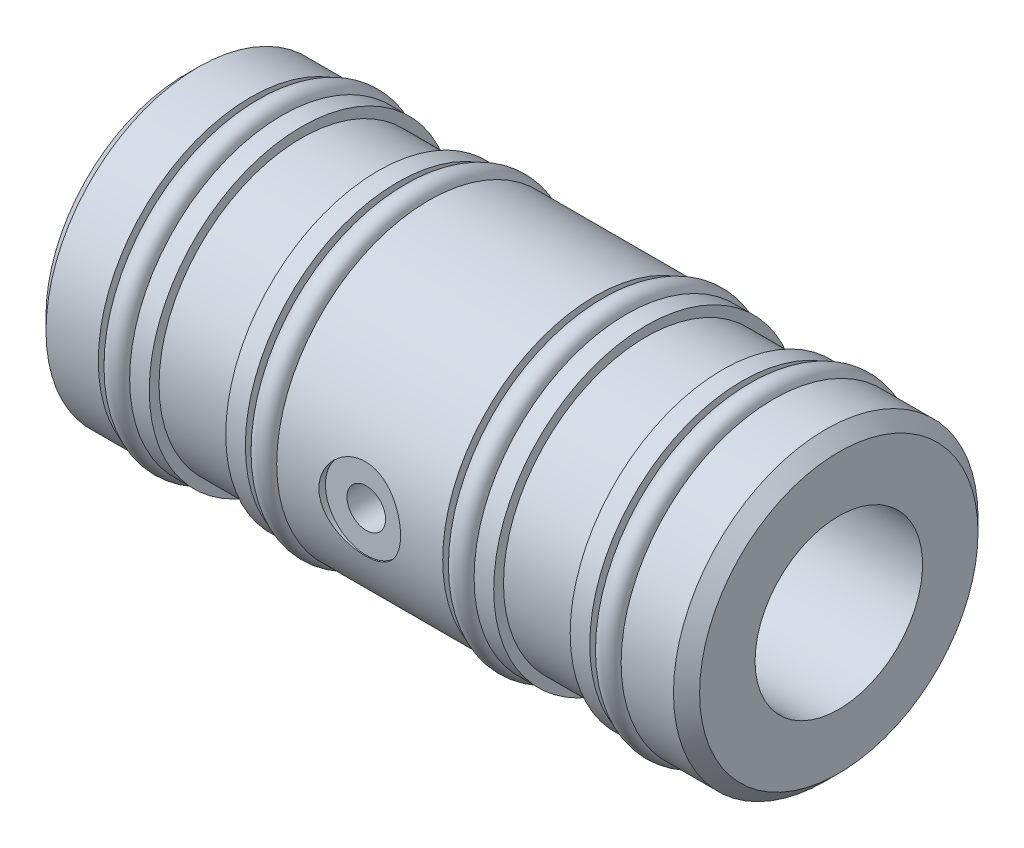
ISO-10303-21;
HEADER;
FILE_DESCRIPTION(('STEP AP214'),'2;1');
FILE_NAME('part.step','',(''),(''),'','','');
FILE_SCHEMA(('AUTOMOTIVE_DESIGN { 1 0 10303 214 1 1 1 1 }'));
ENDSEC;
DATA;
#1=APPLICATION_CONTEXT('core data for automotive mechanical design processes');
#2=APPLICATION_PROTOCOL_DEFINITION('international standard','automotive_design',2000,#1);
#3=PRODUCT_CONTEXT('',#1,'mechanical');
#4=PRODUCT('Part','Part','',(#3));
#5=PRODUCT_RELATED_PRODUCT_CATEGORY('part','',(#4));
#6=PRODUCT_DEFINITION_FORMATION('','',#4);
#7=PRODUCT_DEFINITION_CONTEXT('part definition',#1,'design');
#8=PRODUCT_DEFINITION('design','',#6,#7);
#9=PRODUCT_DEFINITION_SHAPE('','',#8);
#10=(LENGTH_UNIT() NAMED_UNIT(*) SI_UNIT(.MILLI.,.METRE.));
#11=(NAMED_UNIT(*) PLANE_ANGLE_UNIT() SI_UNIT($,.RADIAN.));
#12=(NAMED_UNIT(*) SI_UNIT($,.STERADIAN.) SOLID_ANGLE_UNIT());
#13=UNCERTAINTY_MEASURE_WITH_UNIT(LENGTH_MEASURE(1.E-05),#10,'distance_accuracy_value','');
#14=(GEOMETRIC_REPRESENTATION_CONTEXT(3) GLOBAL_UNCERTAINTY_ASSIGNED_CONTEXT((#13)) GLOBAL_UNIT_ASSIGNED_CONTEXT((#10,
#11,#12)) REPRESENTATION_CONTEXT('',''));
#15=CARTESIAN_POINT('',(0.,0.,0.));
#16=DIRECTION('',(0.,0.,1.));
#17=DIRECTION('',(1.,0.,0.));
#18=AXIS2_PLACEMENT_3D('',#15,#16,#17);
#19=CARTESIAN_POINT('',(0.,0.,0.));
#20=DIRECTION('',(-1.,0.,0.));
#21=DIRECTION('',(0.,0.,1.));
#22=AXIS2_PLACEMENT_3D('',#19,#20,#21);
#23=CYLINDRICAL_SURFACE('',#22,10.615);
#24=CARTESIAN_POINT('',(5.08,0.,0.));
#25=DIRECTION('',(-1.,0.,0.));
#26=DIRECTION('',(0.,0.,1.));
#27=AXIS2_PLACEMENT_3D('',#24,#25,#26);
#28=CIRCLE('',#27,10.615);
#29=CARTESIAN_POINT('',(5.08,0.,10.615));
#30=VERTEX_POINT('',#29);
#31=EDGE_CURVE('E200',#30,#30,#28,.T.);
#32=ORIENTED_EDGE('',*,*,#31,.F.);
#33=EDGE_LOOP('',(#32));
#34=FACE_BOUND('',#33,.T.);
#35=CARTESIAN_POINT('',(5.86030712662578,0.,0.));
#36=DIRECTION('',(1.,0.,0.));
#37=DIRECTION('',(0.,0.,-1.));
#38=AXIS2_PLACEMENT_3D('',#35,#36,#37);
#39=CIRCLE('',#38,10.615);
#40=CARTESIAN_POINT('',(5.86030712662578,0.,-10.615));
#41=VERTEX_POINT('',#40);
#42=EDGE_CURVE('E13',#41,#41,#39,.T.);
#43=ORIENTED_EDGE('',*,*,#42,.F.);
#44=EDGE_LOOP('',(#43));
#45=FACE_BOUND('',#44,.T.);
#46=ADVANCED_FACE('F44',(#34,#45),#23,.T.);
#47=CARTESIAN_POINT('',(7.51800000000001,0.,0.));
#48=DIRECTION('',(-1.,0.,0.));
#49=DIRECTION('',(0.,0.,1.));
#50=AXIS2_PLACEMENT_3D('',#47,#48,#49);
#51=CIRCLE('',#50,10.615);
#52=CARTESIAN_POINT('',(7.51800000000001,0.,10.615));
#53=VERTEX_POINT('',#52);
#54=EDGE_CURVE('E283',#53,#53,#51,.T.);
#55=ORIENTED_EDGE('',*,*,#54,.T.);
#56=EDGE_LOOP('',(#55));
#57=FACE_BOUND('',#56,.T.);
#58=CARTESIAN_POINT('',(6.73729287337424,0.,0.));
#59=DIRECTION('',(-1.,0.,0.));
#60=DIRECTION('',(0.,0.,1.));
#61=AXIS2_PLACEMENT_3D('',#58,#59,#60);
#62=CIRCLE('',#61,10.615);
#63=CARTESIAN_POINT('',(6.73729287337424,0.,10.615));
#64=VERTEX_POINT('',#63);
#65=EDGE_CURVE('E52',#64,#64,#62,.T.);
#66=ORIENTED_EDGE('',*,*,#65,.F.);
#67=EDGE_LOOP('',(#66));
#68=FACE_BOUND('',#67,.T.);
#69=ADVANCED_FACE('F157',(#57,#68),#23,.T.);
#70=CARTESIAN_POINT('',(0.,0.,0.));
#71=DIRECTION('',(-1.,0.,0.));
#72=DIRECTION('',(0.,0.,1.));
#73=AXIS2_PLACEMENT_3D('',#70,#71,#72);
#74=CYLINDRICAL_SURFACE('',#73,10.615);
#75=CARTESIAN_POINT('',(16.51,0.,0.));
#76=DIRECTION('',(-1.,0.,0.));
#77=DIRECTION('',(0.,0.,1.));
#78=AXIS2_PLACEMENT_3D('',#75,#76,#77);
#79=CIRCLE('',#78,10.615);
#80=CARTESIAN_POINT('',(16.51,0.,10.615));
#81=VERTEX_POINT('',#80);
#82=EDGE_CURVE('E262',#81,#81,#79,.T.);
#83=ORIENTED_EDGE('',*,*,#82,.F.);
#84=EDGE_LOOP('',(#83));
#85=FACE_BOUND('',#84,.T.);
#86=CARTESIAN_POINT('',(17.2895071266258,0.,0.));
#87=DIRECTION('',(1.,0.,0.));
#88=DIRECTION('',(0.,0.,-1.));
#89=AXIS2_PLACEMENT_3D('',#86,#87,#88);
#90=CIRCLE('',#89,10.615);
#91=CARTESIAN_POINT('',(17.2895071266258,0.,-10.615));
#92=VERTEX_POINT('',#91);
#93=EDGE_CURVE('E334',#92,#92,#90,.T.);
#94=ORIENTED_EDGE('',*,*,#93,.F.);
#95=EDGE_LOOP('',(#94));
#96=FACE_BOUND('',#95,.T.);
#97=ADVANCED_FACE('F163',(#85,#96),#74,.T.);
#98=CARTESIAN_POINT('',(18.948,0.,0.));
#99=DIRECTION('',(-1.,0.,0.));
#100=DIRECTION('',(0.,0.,1.));
#101=AXIS2_PLACEMENT_3D('',#98,#99,#100);
#102=CIRCLE('',#101,10.615);
#103=CARTESIAN_POINT('',(18.948,0.,10.615));
#104=VERTEX_POINT('',#103);
#105=EDGE_CURVE('E259',#104,#104,#102,.T.);
#106=ORIENTED_EDGE('',*,*,#105,.T.);
#107=EDGE_LOOP('',(#106));
#108=FACE_BOUND('',#107,.T.);
#109=CARTESIAN_POINT('',(18.1664928733742,0.,0.));
#110=DIRECTION('',(-1.,0.,0.));
#111=DIRECTION('',(0.,0.,1.));
#112=AXIS2_PLACEMENT_3D('',#109,#110,#111);
#113=CIRCLE('',#112,10.615);
#114=CARTESIAN_POINT('',(18.1664928733742,0.,10.615));
#115=VERTEX_POINT('',#114);
#116=EDGE_CURVE('E336',#115,#115,#113,.T.);
#117=ORIENTED_EDGE('',*,*,#116,.F.);
#118=EDGE_LOOP('',(#117));
#119=FACE_BOUND('',#118,.T.);
#120=ADVANCED_FACE('F146',(#108,#119),#74,.T.);
#121=CARTESIAN_POINT('',(0.,0.,0.));
#122=DIRECTION('',(-1.,0.,0.));
#123=DIRECTION('',(0.,0.,1.));
#124=AXIS2_PLACEMENT_3D('',#121,#122,#123);
#125=CYLINDRICAL_SURFACE('',#124,10.615);
#126=CARTESIAN_POINT('',(31.85,0.,0.));
#127=DIRECTION('',(-1.,0.,0.));
#128=DIRECTION('',(0.,0.,1.));
#129=AXIS2_PLACEMENT_3D('',#126,#127,#128);
#130=CIRCLE('',#129,10.615);
#131=CARTESIAN_POINT('',(31.85,0.,10.615));
#132=VERTEX_POINT('',#131);
#133=EDGE_CURVE('E250',#132,#132,#130,.T.);
#134=ORIENTED_EDGE('',*,*,#133,.F.);
#135=EDGE_LOOP('',(#134));
#136=FACE_BOUND('',#135,.T.);
#137=CARTESIAN_POINT('',(32.6315071266258,0.,0.));
#138=DIRECTION('',(1.,0.,0.));
#139=DIRECTION('',(0.,0.,-1.));
#140=AXIS2_PLACEMENT_3D('',#137,#138,#139);
#141=CIRCLE('',#140,10.615);
#142=CARTESIAN_POINT('',(32.6315071266258,0.,-10.615));
#143=VERTEX_POINT('',#142);
#144=EDGE_CURVE('E340',#143,#143,#141,.T.);
#145=ORIENTED_EDGE('',*,*,#144,.F.);
#146=EDGE_LOOP('',(#145));
#147=FACE_BOUND('',#146,.T.);
#148=ADVANCED_FACE('F144',(#136,#147),#125,.T.);
#149=CARTESIAN_POINT('',(34.288,0.,0.));
#150=DIRECTION('',(-1.,0.,0.));
#151=DIRECTION('',(0.,0.,1.));
#152=AXIS2_PLACEMENT_3D('',#149,#150,#151);
#153=CIRCLE('',#152,10.615);
#154=CARTESIAN_POINT('',(34.288,0.,10.615));
#155=VERTEX_POINT('',#154);
#156=EDGE_CURVE('E247',#155,#155,#153,.T.);
#157=ORIENTED_EDGE('',*,*,#156,.T.);
#158=EDGE_LOOP('',(#157));
#159=FACE_BOUND('',#158,.T.);
#160=CARTESIAN_POINT('',(33.5084928733742,0.,0.));
#161=DIRECTION('',(-1.,0.,0.));
#162=DIRECTION('',(0.,0.,1.));
#163=AXIS2_PLACEMENT_3D('',#160,#161,#162);
#164=CIRCLE('',#163,10.615);
#165=CARTESIAN_POINT('',(33.5084928733742,0.,10.615));
#166=VERTEX_POINT('',#165);
#167=EDGE_CURVE('E345',#166,#166,#164,.T.);
#168=ORIENTED_EDGE('',*,*,#167,.F.);
#169=EDGE_LOOP('',(#168));
#170=FACE_BOUND('',#169,.T.);
#171=ADVANCED_FACE('F114',(#159,#170),#125,.T.);
#172=CARTESIAN_POINT('',(0.,0.,0.));
#173=DIRECTION('',(-1.,0.,0.));
#174=DIRECTION('',(0.,0.,1.));
#175=AXIS2_PLACEMENT_3D('',#172,#173,#174);
#176=CYLINDRICAL_SURFACE('',#175,10.615);
#177=CARTESIAN_POINT('',(43.28,0.,0.));
#178=DIRECTION('',(-1.,0.,0.));
#179=DIRECTION('',(0.,0.,1.));
#180=AXIS2_PLACEMENT_3D('',#177,#178,#179);
#181=CIRCLE('',#180,10.615);
#182=CARTESIAN_POINT('',(43.28,0.,10.615));
#183=VERTEX_POINT('',#182);
#184=EDGE_CURVE('E226',#183,#183,#181,.T.);
#185=ORIENTED_EDGE('',*,*,#184,.F.);
#186=EDGE_LOOP('',(#185));
#187=FACE_BOUND('',#186,.T.);
#188=CARTESIAN_POINT('',(44.0615071266258,0.,0.));
#189=DIRECTION('',(1.,0.,0.));
#190=DIRECTION('',(0.,0.,-1.));
#191=AXIS2_PLACEMENT_3D('',#188,#189,#190);
#192=CIRCLE('',#191,10.615);
#193=CARTESIAN_POINT('',(44.0615071266258,0.,-10.615));
#194=VERTEX_POINT('',#193);
#195=EDGE_CURVE('E69',#194,#194,#192,.T.);
#196=ORIENTED_EDGE('',*,*,#195,.F.);
#197=EDGE_LOOP('',(#196));
#198=FACE_BOUND('',#197,.T.);
#199=ADVANCED_FACE('F110',(#187,#198),#176,.T.);
#200=CARTESIAN_POINT('',(45.718,0.,0.));
#201=DIRECTION('',(-1.,0.,0.));
#202=DIRECTION('',(0.,0.,1.));
#203=AXIS2_PLACEMENT_3D('',#200,#201,#202);
#204=CIRCLE('',#203,10.615);
#205=CARTESIAN_POINT('',(45.718,0.,10.615));
#206=VERTEX_POINT('',#205);
#207=EDGE_CURVE('E217',#206,#206,#204,.T.);
#208=ORIENTED_EDGE('',*,*,#207,.T.);
#209=EDGE_LOOP('',(#208));
#210=FACE_BOUND('',#209,.T.);
#211=CARTESIAN_POINT('',(44.9384928733742,0.,0.));
#212=DIRECTION('',(-1.,0.,0.));
#213=DIRECTION('',(0.,0.,1.));
#214=AXIS2_PLACEMENT_3D('',#211,#212,#213);
#215=CIRCLE('',#214,10.615);
#216=CARTESIAN_POINT('',(44.9384928733742,0.,10.615));
#217=VERTEX_POINT('',#216);
#218=EDGE_CURVE('E67',#217,#217,#215,.T.);
#219=ORIENTED_EDGE('',*,*,#218,.F.);
#220=EDGE_LOOP('',(#219));
#221=FACE_BOUND('',#220,.T.);
#222=ADVANCED_FACE('F113',(#210,#221),#176,.T.);
#223=CARTESIAN_POINT('',(0.,6.51,0.));
#224=DIRECTION('',(1.,0.,0.));
#225=DIRECTION('',(0.,0.,-1.));
#226=AXIS2_PLACEMENT_3D('',#223,#224,#225);
#227=PLANE('',#226);
#228=CARTESIAN_POINT('',(0.,0.,0.));
#229=DIRECTION('',(1.,0.,0.));
#230=DIRECTION('',(0.,0.,-1.));
#231=AXIS2_PLACEMENT_3D('',#228,#229,#230);
#232=CIRCLE('',#231,10.819);
#233=CARTESIAN_POINT('',(0.,0.,-10.819));
#234=VERTEX_POINT('',#233);
#235=EDGE_CURVE('E194',#234,#234,#232,.F.);
#236=ORIENTED_EDGE('',*,*,#235,.T.);
#237=EDGE_LOOP('',(#236));
#238=FACE_BOUND('',#237,.T.);
#239=CARTESIAN_POINT('',(0.,0.,0.));
#240=DIRECTION('',(-1.,0.,0.));
#241=DIRECTION('',(0.,0.,1.));
#242=AXIS2_PLACEMENT_3D('',#239,#240,#241);
#243=CIRCLE('',#242,6.51);
#244=CARTESIAN_POINT('',(0.,0.,6.51));
#245=VERTEX_POINT('',#244);
#246=EDGE_CURVE('E214',#245,#245,#243,.T.);
#247=ORIENTED_EDGE('',*,*,#246,.F.);
#248=EDGE_LOOP('',(#247));
#249=FACE_BOUND('',#248,.T.);
#250=ADVANCED_FACE('F178',(#238,#249),#227,.F.);
#251=CARTESIAN_POINT('',(0.,0.,0.));
#252=DIRECTION('',(-1.,0.,0.));
#253=DIRECTION('',(0.,0.,1.));
#254=AXIS2_PLACEMENT_3D('',#251,#252,#253);
#255=CYLINDRICAL_SURFACE('',#254,11.835);
#256=CARTESIAN_POINT('',(1.01600000000001,0.,0.));
#257=DIRECTION('',(1.,0.,0.));
#258=DIRECTION('',(0.,0.,-1.));
#259=AXIS2_PLACEMENT_3D('',#256,#257,#258);
#260=CIRCLE('',#259,11.835);
#261=CARTESIAN_POINT('',(1.01600000000001,0.,-11.835));
#262=VERTEX_POINT('',#261);
#263=EDGE_CURVE('E191',#262,#262,#260,.T.);
#264=ORIENTED_EDGE('',*,*,#263,.T.);
#265=EDGE_LOOP('',(#264));
#266=FACE_BOUND('',#265,.T.);
#267=CARTESIAN_POINT('',(5.08,0.,0.));
#268=DIRECTION('',(-1.,0.,0.));
#269=DIRECTION('',(0.,0.,1.));
#270=AXIS2_PLACEMENT_3D('',#267,#268,#269);
#271=CIRCLE('',#270,11.835);
#272=CARTESIAN_POINT('',(5.08,0.,11.835));
#273=VERTEX_POINT('',#272);
#274=EDGE_CURVE('E195',#273,#273,#271,.T.);
#275=ORIENTED_EDGE('',*,*,#274,.T.);
#276=EDGE_LOOP('',(#275));
#277=FACE_BOUND('',#276,.T.);
#278=ADVANCED_FACE('F174',(#266,#277),#255,.T.);
#279=CARTESIAN_POINT('',(5.08,11.835,0.));
#280=DIRECTION('',(-1.,0.,0.));
#281=DIRECTION('',(0.,0.,1.));
#282=AXIS2_PLACEMENT_3D('',#279,#280,#281);
#283=PLANE('',#282);
#284=ORIENTED_EDGE('',*,*,#274,.F.);
#285=EDGE_LOOP('',(#284));
#286=FACE_BOUND('',#285,.T.);
#287=ORIENTED_EDGE('',*,*,#31,.T.);
#288=EDGE_LOOP('',(#287));
#289=FACE_BOUND('',#288,.T.);
#290=ADVANCED_FACE('F171',(#286,#289),#283,.F.);
#291=CARTESIAN_POINT('',(7.51800000000001,10.615,0.));
#292=DIRECTION('',(1.,0.,0.));
#293=DIRECTION('',(0.,0.,-1.));
#294=AXIS2_PLACEMENT_3D('',#291,#292,#293);
#295=PLANE('',#294);
#296=ORIENTED_EDGE('',*,*,#54,.F.);
#297=EDGE_LOOP('',(#296));
#298=FACE_BOUND('',#297,.T.);
#299=CARTESIAN_POINT('',(7.51800000000001,0.,0.));
#300=DIRECTION('',(-1.,0.,0.));
#301=DIRECTION('',(0.,0.,1.));
#302=AXIS2_PLACEMENT_3D('',#299,#300,#301);
#303=CIRCLE('',#302,11.835);
#304=CARTESIAN_POINT('',(7.51800000000001,0.,11.835));
#305=VERTEX_POINT('',#304);
#306=EDGE_CURVE('E280',#305,#305,#303,.T.);
#307=ORIENTED_EDGE('',*,*,#306,.T.);
#308=EDGE_LOOP('',(#307));
#309=FACE_BOUND('',#308,.T.);
#310=ADVANCED_FACE('F169',(#298,#309),#295,.F.);
#311=CARTESIAN_POINT('',(0.,0.,0.));
#312=DIRECTION('',(-1.,0.,0.));
#313=DIRECTION('',(0.,0.,1.));
#314=AXIS2_PLACEMENT_3D('',#311,#312,#313);
#315=CYLINDRICAL_SURFACE('',#314,11.835);
#316=ORIENTED_EDGE('',*,*,#306,.F.);
#317=EDGE_LOOP('',(#316));
#318=FACE_BOUND('',#317,.T.);
#319=CARTESIAN_POINT('',(9.0424,0.,0.));
#320=DIRECTION('',(-1.,0.,0.));
#321=DIRECTION('',(0.,0.,1.));
#322=AXIS2_PLACEMENT_3D('',#319,#320,#321);
#323=CIRCLE('',#322,11.835);
#324=CARTESIAN_POINT('',(9.0424,0.,11.835));
#325=VERTEX_POINT('',#324);
#326=EDGE_CURVE('E277',#325,#325,#323,.T.);
#327=ORIENTED_EDGE('',*,*,#326,.T.);
#328=EDGE_LOOP('',(#327));
#329=FACE_BOUND('',#328,.T.);
#330=ADVANCED_FACE('F292',(#318,#329),#315,.T.);
#331=CARTESIAN_POINT('',(9.0424,11.835,0.));
#332=DIRECTION('',(-1.,0.,0.));
#333=DIRECTION('',(0.,0.,1.));
#334=AXIS2_PLACEMENT_3D('',#331,#332,#333);
#335=PLANE('',#334);
#336=ORIENTED_EDGE('',*,*,#326,.F.);
#337=EDGE_LOOP('',(#336));
#338=FACE_BOUND('',#337,.T.);
#339=CARTESIAN_POINT('',(9.0424,0.,0.));
#340=DIRECTION('',(-1.,0.,0.));
#341=DIRECTION('',(0.,0.,1.));
#342=AXIS2_PLACEMENT_3D('',#339,#340,#341);
#343=CIRCLE('',#342,11.075);
#344=CARTESIAN_POINT('',(9.0424,0.,11.075));
#345=VERTEX_POINT('',#344);
#346=EDGE_CURVE('E274',#345,#345,#343,.T.);
#347=ORIENTED_EDGE('',*,*,#346,.T.);
#348=EDGE_LOOP('',(#347));
#349=FACE_BOUND('',#348,.T.);
#350=ADVANCED_FACE('F297',(#338,#349),#335,.F.);
#351=CARTESIAN_POINT('',(0.,0.,0.));
#352=DIRECTION('',(-1.,0.,0.));
#353=DIRECTION('',(0.,0.,1.));
#354=AXIS2_PLACEMENT_3D('',#351,#352,#353);
#355=CYLINDRICAL_SURFACE('',#354,11.075);
#356=ORIENTED_EDGE('',*,*,#346,.F.);
#357=EDGE_LOOP('',(#356));
#358=FACE_BOUND('',#357,.T.);
#359=CARTESIAN_POINT('',(14.986,0.,0.));
#360=DIRECTION('',(-1.,0.,0.));
#361=DIRECTION('',(0.,0.,1.));
#362=AXIS2_PLACEMENT_3D('',#359,#360,#361);
#363=CIRCLE('',#362,11.075);
#364=CARTESIAN_POINT('',(14.986,0.,11.075));
#365=VERTEX_POINT('',#364);
#366=EDGE_CURVE('E271',#365,#365,#363,.T.);
#367=ORIENTED_EDGE('',*,*,#366,.T.);
#368=EDGE_LOOP('',(#367));
#369=FACE_BOUND('',#368,.T.);
#370=ADVANCED_FACE('F302',(#358,#369),#355,.T.);
#371=CARTESIAN_POINT('',(14.986,11.075,0.));
#372=DIRECTION('',(1.,0.,0.));
#373=DIRECTION('',(0.,0.,-1.));
#374=AXIS2_PLACEMENT_3D('',#371,#372,#373);
#375=PLANE('',#374);
#376=ORIENTED_EDGE('',*,*,#366,.F.);
#377=EDGE_LOOP('',(#376));
#378=FACE_BOUND('',#377,.T.);
#379=CARTESIAN_POINT('',(14.986,0.,0.));
#380=DIRECTION('',(-1.,0.,0.));
#381=DIRECTION('',(0.,0.,1.));
#382=AXIS2_PLACEMENT_3D('',#379,#380,#381);
#383=CIRCLE('',#382,11.835);
#384=CARTESIAN_POINT('',(14.986,0.,11.835));
#385=VERTEX_POINT('',#384);
#386=EDGE_CURVE('E268',#385,#385,#383,.T.);
#387=ORIENTED_EDGE('',*,*,#386,.T.);
#388=EDGE_LOOP('',(#387));
#389=FACE_BOUND('',#388,.T.);
#390=ADVANCED_FACE('F308',(#378,#389),#375,.F.);
#391=CARTESIAN_POINT('',(0.,0.,0.));
#392=DIRECTION('',(-1.,0.,0.));
#393=DIRECTION('',(0.,0.,1.));
#394=AXIS2_PLACEMENT_3D('',#391,#392,#393);
#395=CYLINDRICAL_SURFACE('',#394,11.835);
#396=ORIENTED_EDGE('',*,*,#386,.F.);
#397=EDGE_LOOP('',(#396));
#398=FACE_BOUND('',#397,.T.);
#399=CARTESIAN_POINT('',(16.51,0.,0.));
#400=DIRECTION('',(-1.,0.,0.));
#401=DIRECTION('',(0.,0.,1.));
#402=AXIS2_PLACEMENT_3D('',#399,#400,#401);
#403=CIRCLE('',#402,11.835);
#404=CARTESIAN_POINT('',(16.51,0.,11.835));
#405=VERTEX_POINT('',#404);
#406=EDGE_CURVE('E265',#405,#405,#403,.T.);
#407=ORIENTED_EDGE('',*,*,#406,.T.);
#408=EDGE_LOOP('',(#407));
#409=FACE_BOUND('',#408,.T.);
#410=ADVANCED_FACE('F314',(#398,#409),#395,.T.);
#411=CARTESIAN_POINT('',(16.51,11.835,0.));
#412=DIRECTION('',(-1.,0.,0.));
#413=DIRECTION('',(0.,0.,1.));
#414=AXIS2_PLACEMENT_3D('',#411,#412,#413);
#415=PLANE('',#414);
#416=ORIENTED_EDGE('',*,*,#406,.F.);
#417=EDGE_LOOP('',(#416));
#418=FACE_BOUND('',#417,.T.);
#419=ORIENTED_EDGE('',*,*,#82,.T.);
#420=EDGE_LOOP('',(#419));
#421=FACE_BOUND('',#420,.T.);
#422=ADVANCED_FACE('F320',(#418,#421),#415,.F.);
#423=CARTESIAN_POINT('',(18.948,10.615,0.));
#424=DIRECTION('',(1.,0.,0.));
#425=DIRECTION('',(0.,0.,-1.));
#426=AXIS2_PLACEMENT_3D('',#423,#424,#425);
#427=PLANE('',#426);
#428=ORIENTED_EDGE('',*,*,#105,.F.);
#429=EDGE_LOOP('',(#428));
#430=FACE_BOUND('',#429,.T.);
#431=CARTESIAN_POINT('',(18.948,0.,0.));
#432=DIRECTION('',(-1.,0.,0.));
#433=DIRECTION('',(0.,0.,1.));
#434=AXIS2_PLACEMENT_3D('',#431,#432,#433);
#435=CIRCLE('',#434,11.835);
#436=CARTESIAN_POINT('',(18.948,0.,11.835));
#437=VERTEX_POINT('',#436);
#438=EDGE_CURVE('E256',#437,#437,#435,.T.);
#439=ORIENTED_EDGE('',*,*,#438,.T.);
#440=EDGE_LOOP('',(#439));
#441=FACE_BOUND('',#440,.T.);
#442=ADVANCED_FACE('F153',(#430,#441),#427,.F.);
#443=CARTESIAN_POINT('',(0.,0.,0.));
#444=DIRECTION('',(-1.,0.,0.));
#445=DIRECTION('',(0.,0.,1.));
#446=AXIS2_PLACEMENT_3D('',#443,#444,#445);
#447=CYLINDRICAL_SURFACE('',#446,11.835);
#448=CARTESIAN_POINT('',(28.575,0.,11.835));
#449=CARTESIAN_POINT('',(28.5749959276664,-0.174990148508557,11.8349974009884));
#450=CARTESIAN_POINT('',(28.5604846457138,-0.350023777169338,11.8310807969796));
#451=CARTESIAN_POINT('',(28.5029272510792,-0.695046285621521,11.8158371547024));
#452=CARTESIAN_POINT('',(28.459867647965,-0.86503274068879,11.8045066130309));
#453=CARTESIAN_POINT('',(28.3467162058972,-1.19493096117319,11.7756852764638));
#454=CARTESIAN_POINT('',(28.2766594546597,-1.35485549135068,11.7582024800951));
#455=CARTESIAN_POINT('',(28.1116330862924,-1.66068533552397,11.7189228449473));
#456=CARTESIAN_POINT('',(28.0166617294275,-1.80658966954613,11.6971257049327));
#457=CARTESIAN_POINT('',(27.8021517253947,-2.08365772612319,11.6509980904961));
#458=CARTESIAN_POINT('',(27.6821374889953,-2.21444597016168,11.6266239061451));
#459=CARTESIAN_POINT('',(27.4219650073318,-2.45430136746269,11.5783690546668));
#460=CARTESIAN_POINT('',(27.2818041395723,-2.56336568849665,11.5544884522529));
#461=CARTESIAN_POINT('',(26.9823117611484,-2.75851463739301,11.5094768167641));
#462=CARTESIAN_POINT('',(26.8226889623298,-2.84416610961409,11.4884008948909));
#463=CARTESIAN_POINT('',(26.4906515894736,-2.98726761431123,11.4520280627882));
#464=CARTESIAN_POINT('',(26.3182394127479,-3.04472291673369,11.4367300727696));
#465=CARTESIAN_POINT('',(25.9696785916844,-3.12849482076006,11.414096671777));
#466=CARTESIAN_POINT('',(25.7937052586006,-3.15549272863076,11.4065873578984));
#467=CARTESIAN_POINT('',(25.4395791686212,-3.17970771095938,11.3998620673222));
#468=CARTESIAN_POINT('',(25.2614268306598,-3.17693042280177,11.4006445207309));
#469=CARTESIAN_POINT('',(24.9133274935245,-3.14221447388887,11.4102587795664));
#470=CARTESIAN_POINT('',(24.7432908493768,-3.11110150935184,11.4188626571771));
#471=CARTESIAN_POINT('',(24.410944121269,-3.0219203778859,11.4427851966351));
#472=CARTESIAN_POINT('',(24.2486346626473,-2.9638500334506,11.4581044009135));
#473=CARTESIAN_POINT('',(23.9342035008203,-2.82173272634338,11.4939310678526));
#474=CARTESIAN_POINT('',(23.7822189639378,-2.73739729744882,11.5144956621415));
#475=CARTESIAN_POINT('',(23.4942694581827,-2.54534499850843,11.5584654359199));
#476=CARTESIAN_POINT('',(23.3583076853505,-2.43762347580632,11.5818711802462));
#477=CARTESIAN_POINT('',(23.1015471309255,-2.19764048201091,11.6298336620565));
#478=CARTESIAN_POINT('',(22.9813974938947,-2.0646859935101,11.6544028819639));
#479=CARTESIAN_POINT('',(22.7649662497452,-1.78021460187993,11.7012311152843));
#480=CARTESIAN_POINT('',(22.6686856059073,-1.6286969499657,11.7234900354395));
#481=CARTESIAN_POINT('',(22.5024347822499,-1.31038706767949,11.7633293605368));
#482=CARTESIAN_POINT('',(22.4325832797432,-1.14353002523041,11.7808885611017));
#483=CARTESIAN_POINT('',(22.3221105757009,-0.799862273340458,11.8091967799814));
#484=CARTESIAN_POINT('',(22.2814829071705,-0.623053775418689,11.8199473049374));
#485=CARTESIAN_POINT('',(22.2316331764743,-0.270040992001906,11.8331985507798));
#486=CARTESIAN_POINT('',(22.2215286832369,-0.0939698269246398,11.8359310070054));
#487=CARTESIAN_POINT('',(22.2305735267045,0.257351736342877,11.8335051154181));
#488=CARTESIAN_POINT('',(22.249719800451,0.43260221854249,11.8283475937947));
#489=CARTESIAN_POINT('',(22.3159993049438,0.774149904716212,11.8108710334964));
#490=CARTESIAN_POINT('',(22.3626392741215,0.940549885837622,11.7986782927072));
#491=CARTESIAN_POINT('',(22.4820084920628,1.26314695656749,11.7685154357869));
#492=CARTESIAN_POINT('',(22.554740585281,1.4193429315823,11.7505446897841));
#493=CARTESIAN_POINT('',(22.7258590379079,1.72051869989344,11.7102775181579));
#494=CARTESIAN_POINT('',(22.8247240345798,1.86521579126867,11.6879026168165));
#495=CARTESIAN_POINT('',(23.0447011087703,2.13627537923722,11.6414130274417));
#496=CARTESIAN_POINT('',(23.165817635598,2.26263419993723,11.6172979920461));
#497=CARTESIAN_POINT('',(23.4309794253043,2.49715670616408,11.569191682587));
#498=CARTESIAN_POINT('',(23.5755808520467,2.60469749532788,11.5452236235277));
#499=CARTESIAN_POINT('',(23.8812853791771,2.794002033688,11.5008811103949));
#500=CARTESIAN_POINT('',(24.0423877975513,2.87576684767955,11.4805065078925));
#501=CARTESIAN_POINT('',(24.3757264514236,3.01058359040366,11.4458926491731));
#502=CARTESIAN_POINT('',(24.5478919332002,3.06380092061823,11.4316181497345));
#503=CARTESIAN_POINT('',(24.8991768877708,3.14039743486302,11.410816544273));
#504=CARTESIAN_POINT('',(25.0782945447985,3.16378435666646,11.4042874291891));
#505=CARTESIAN_POINT('',(25.4320180805646,3.17960719342951,11.3998850899541));
#506=CARTESIAN_POINT('',(25.6065763282001,3.17304486994606,11.4017316963489));
#507=CARTESIAN_POINT('',(25.9519992573988,3.1314823193828,11.4132159678365));
#508=CARTESIAN_POINT('',(26.1228640360751,3.09648284094201,11.4228534278266));
#509=CARTESIAN_POINT('',(26.4547718738463,2.99962348110233,11.4486657244807));
#510=CARTESIAN_POINT('',(26.6158819411534,2.93797829036701,11.4647882389504));
#511=CARTESIAN_POINT('',(26.92559524282,2.7897440190188,11.5017547565645));
#512=CARTESIAN_POINT('',(27.0741964889062,2.70315098259091,11.5225995083708));
#513=CARTESIAN_POINT('',(27.359449598452,2.5044532678537,11.5674365499621));
#514=CARTESIAN_POINT('',(27.4956143360778,2.39166615043482,11.5915040402123));
#515=CARTESIAN_POINT('',(27.7474100255687,2.14507657150452,11.6396574774815));
#516=CARTESIAN_POINT('',(27.8630359637827,2.01126899374559,11.6637434275696));
#517=CARTESIAN_POINT('',(28.0729433320003,1.72292853808375,11.7098458865271));
#518=CARTESIAN_POINT('',(28.1667063545946,1.56800848607283,11.7318060539925));
#519=CARTESIAN_POINT('',(28.3267103840538,1.24402029890912,11.7705639166145));
#520=CARTESIAN_POINT('',(28.39296883963,1.07496121551197,11.7873648829672));
#521=CARTESIAN_POINT('',(28.4875617580769,0.755471215386146,11.811770298213));
#522=CARTESIAN_POINT('',(28.5202743886877,0.606401636757786,11.8204175802852));
#523=CARTESIAN_POINT('',(28.5639941838353,0.304898812849366,11.8320332756483));
#524=CARTESIAN_POINT('',(28.5750035481543,0.152465910050237,11.8350022644742));
#525=CARTESIAN_POINT('',(28.575,0.,11.835));
#526=B_SPLINE_CURVE_WITH_KNOTS('',3,(#448,#449,#450,#451,#452,#453,#454,#455,#456,#457,#458,
#459,#460,#461,#462,#463,#464,#465,#466,#467,#468,#469,#470,#471,#472,#473,#474,#475,#476,#477,
#478,#479,#480,#481,#482,#483,#484,#485,#486,#487,#488,#489,#490,#491,#492,#493,#494,#495,#496,
#497,#498,#499,#500,#501,#502,#503,#504,#505,#506,#507,#508,#509,#510,#511,#512,#513,#514,#515,
#516,#517,#518,#519,#520,#521,#522,#523,#524,#525),.UNSPECIFIED.,.T.,.F.,(4,2,2,2,2,2,2,2,2,2,2,
2,2,2,2,2,2,2,2,2,2,2,2,2,2,2,2,2,2,2,2,2,2,2,2,2,2,2,4),(0.,0.524411272789092,1.04907053150148,
1.57305018717808,2.09706644100938,2.6321267361997,3.16725674359527,3.7117037821751,
4.25604902322331,4.7879600674591,5.31977040592309,5.83656307025881,6.35339748624828,
6.87612129039124,7.39894918573525,7.93904563744687,8.47916388228013,9.02167947300655,
9.56407497251761,10.0906319977092,10.6171338889024,11.134465610661,11.6518537469137,
12.179467920315,12.7071877079592,13.2499828221931,13.7927555108385,14.3323484951971,
14.8718014848987,15.3933452568455,15.9148752990305,16.4322793722561,16.9497655320209,
17.4826496505297,18.0156636711996,18.5602599551292,19.1045102209076,19.5614670717045,
20.0183776042565),.UNSPECIFIED.);
#527=CARTESIAN_POINT('',(22.225,0.,11.835));
#528=VERTEX_POINT('',#527);
#529=CARTESIAN_POINT('',(28.575,0.,11.835));
#530=VERTEX_POINT('',#529);
#531=EDGE_CURVE('E60',#528,#530,#526,.T.);
#532=ORIENTED_EDGE('',*,*,#531,.T.);
#533=EDGE_CURVE('E58',#530,#528,#526,.T.);
#534=ORIENTED_EDGE('',*,*,#533,.T.);
#535=EDGE_LOOP('',(#532,#534));
#536=FACE_BOUND('',#535,.T.);
#537=ORIENTED_EDGE('',*,*,#438,.F.);
#538=EDGE_LOOP('',(#537));
#539=FACE_BOUND('',#538,.T.);
#540=CARTESIAN_POINT('',(31.85,0.,0.));
#541=DIRECTION('',(-1.,0.,0.));
#542=DIRECTION('',(0.,0.,1.));
#543=AXIS2_PLACEMENT_3D('',#540,#541,#542);
#544=CIRCLE('',#543,11.835);
#545=CARTESIAN_POINT('',(31.85,0.,11.835));
#546=VERTEX_POINT('',#545);
#547=EDGE_CURVE('E253',#546,#546,#544,.T.);
#548=ORIENTED_EDGE('',*,*,#547,.T.);
#549=EDGE_LOOP('',(#548));
#550=FACE_BOUND('',#549,.T.);
#551=ADVANCED_FACE('F65',(#536,#539,#550),#447,.T.);
#552=CARTESIAN_POINT('',(31.85,11.835,0.));
#553=DIRECTION('',(-1.,0.,0.));
#554=DIRECTION('',(0.,0.,1.));
#555=AXIS2_PLACEMENT_3D('',#552,#553,#554);
#556=PLANE('',#555);
#557=ORIENTED_EDGE('',*,*,#547,.F.);
#558=EDGE_LOOP('',(#557));
#559=FACE_BOUND('',#558,.T.);
#560=ORIENTED_EDGE('',*,*,#133,.T.);
#561=EDGE_LOOP('',(#560));
#562=FACE_BOUND('',#561,.T.);
#563=ADVANCED_FACE('F142',(#559,#562),#556,.F.);
#564=CARTESIAN_POINT('',(34.288,11.835,0.));
#565=DIRECTION('',(1.,0.,0.));
#566=DIRECTION('',(0.,0.,-1.));
#567=AXIS2_PLACEMENT_3D('',#564,#565,#566);
#568=PLANE('',#567);
#569=ORIENTED_EDGE('',*,*,#156,.F.);
#570=EDGE_LOOP('',(#569));
#571=FACE_BOUND('',#570,.T.);
#572=CARTESIAN_POINT('',(34.288,0.,0.));
#573=DIRECTION('',(-1.,0.,0.));
#574=DIRECTION('',(0.,0.,1.));
#575=AXIS2_PLACEMENT_3D('',#572,#573,#574);
#576=CIRCLE('',#575,11.835);
#577=CARTESIAN_POINT('',(34.288,0.,11.835));
#578=VERTEX_POINT('',#577);
#579=EDGE_CURVE('E244',#578,#578,#576,.T.);
#580=ORIENTED_EDGE('',*,*,#579,.T.);
#581=EDGE_LOOP('',(#580));
#582=FACE_BOUND('',#581,.T.);
#583=ADVANCED_FACE('F138',(#571,#582),#568,.F.);
#584=CARTESIAN_POINT('',(0.,0.,0.));
#585=DIRECTION('',(-1.,0.,0.));
#586=DIRECTION('',(0.,0.,1.));
#587=AXIS2_PLACEMENT_3D('',#584,#585,#586);
#588=CYLINDRICAL_SURFACE('',#587,11.835);
#589=ORIENTED_EDGE('',*,*,#579,.F.);
#590=EDGE_LOOP('',(#589));
#591=FACE_BOUND('',#590,.T.);
#592=CARTESIAN_POINT('',(35.814,0.,0.));
#593=DIRECTION('',(-1.,0.,0.));
#594=DIRECTION('',(0.,0.,1.));
#595=AXIS2_PLACEMENT_3D('',#592,#593,#594);
#596=CIRCLE('',#595,11.835);
#597=CARTESIAN_POINT('',(35.814,0.,11.835));
#598=VERTEX_POINT('',#597);
#599=EDGE_CURVE('E241',#598,#598,#596,.T.);
#600=ORIENTED_EDGE('',*,*,#599,.T.);
#601=EDGE_LOOP('',(#600));
#602=FACE_BOUND('',#601,.T.);
#603=ADVANCED_FACE('F134',(#591,#602),#588,.T.);
#604=CARTESIAN_POINT('',(35.814,11.075,0.));
#605=DIRECTION('',(-1.,0.,0.));
#606=DIRECTION('',(0.,0.,1.));
#607=AXIS2_PLACEMENT_3D('',#604,#605,#606);
#608=PLANE('',#607);
#609=ORIENTED_EDGE('',*,*,#599,.F.);
#610=EDGE_LOOP('',(#609));
#611=FACE_BOUND('',#610,.T.);
#612=CARTESIAN_POINT('',(35.814,0.,0.));
#613=DIRECTION('',(-1.,0.,0.));
#614=DIRECTION('',(0.,0.,1.));
#615=AXIS2_PLACEMENT_3D('',#612,#613,#614);
#616=CIRCLE('',#615,11.075);
#617=CARTESIAN_POINT('',(35.814,0.,11.075));
#618=VERTEX_POINT('',#617);
#619=EDGE_CURVE('E238',#618,#618,#616,.T.);
#620=ORIENTED_EDGE('',*,*,#619,.T.);
#621=EDGE_LOOP('',(#620));
#622=FACE_BOUND('',#621,.T.);
#623=ADVANCED_FACE('F130',(#611,#622),#608,.F.);
#624=CARTESIAN_POINT('',(0.,0.,0.));
#625=DIRECTION('',(-1.,0.,0.));
#626=DIRECTION('',(0.,0.,1.));
#627=AXIS2_PLACEMENT_3D('',#624,#625,#626);
#628=CYLINDRICAL_SURFACE('',#627,11.075);
#629=ORIENTED_EDGE('',*,*,#619,.F.);
#630=EDGE_LOOP('',(#629));
#631=FACE_BOUND('',#630,.T.);
#632=CARTESIAN_POINT('',(41.7576,0.,0.));
#633=DIRECTION('',(-1.,0.,0.));
#634=DIRECTION('',(0.,0.,1.));
#635=AXIS2_PLACEMENT_3D('',#632,#633,#634);
#636=CIRCLE('',#635,11.075);
#637=CARTESIAN_POINT('',(41.7576,0.,11.075));
#638=VERTEX_POINT('',#637);
#639=EDGE_CURVE('E235',#638,#638,#636,.T.);
#640=ORIENTED_EDGE('',*,*,#639,.T.);
#641=EDGE_LOOP('',(#640));
#642=FACE_BOUND('',#641,.T.);
#643=ADVANCED_FACE('F126',(#631,#642),#628,.T.);
#644=CARTESIAN_POINT('',(41.7576,11.835,0.));
#645=DIRECTION('',(1.,0.,0.));
#646=DIRECTION('',(0.,0.,-1.));
#647=AXIS2_PLACEMENT_3D('',#644,#645,#646);
#648=PLANE('',#647);
#649=ORIENTED_EDGE('',*,*,#639,.F.);
#650=EDGE_LOOP('',(#649));
#651=FACE_BOUND('',#650,.T.);
#652=CARTESIAN_POINT('',(41.7576,0.,0.));
#653=DIRECTION('',(-1.,0.,0.));
#654=DIRECTION('',(0.,0.,1.));
#655=AXIS2_PLACEMENT_3D('',#652,#653,#654);
#656=CIRCLE('',#655,11.835);
#657=CARTESIAN_POINT('',(41.7576,0.,11.835));
#658=VERTEX_POINT('',#657);
#659=EDGE_CURVE('E232',#658,#658,#656,.T.);
#660=ORIENTED_EDGE('',*,*,#659,.T.);
#661=EDGE_LOOP('',(#660));
#662=FACE_BOUND('',#661,.T.);
#663=ADVANCED_FACE('F122',(#651,#662),#648,.F.);
#664=CARTESIAN_POINT('',(0.,0.,0.));
#665=DIRECTION('',(-1.,0.,0.));
#666=DIRECTION('',(0.,0.,1.));
#667=AXIS2_PLACEMENT_3D('',#664,#665,#666);
#668=CYLINDRICAL_SURFACE('',#667,11.835);
#669=ORIENTED_EDGE('',*,*,#659,.F.);
#670=EDGE_LOOP('',(#669));
#671=FACE_BOUND('',#670,.T.);
#672=CARTESIAN_POINT('',(43.28,0.,0.));
#673=DIRECTION('',(-1.,0.,0.));
#674=DIRECTION('',(0.,0.,1.));
#675=AXIS2_PLACEMENT_3D('',#672,#673,#674);
#676=CIRCLE('',#675,11.835);
#677=CARTESIAN_POINT('',(43.28,0.,11.835));
#678=VERTEX_POINT('',#677);
#679=EDGE_CURVE('E229',#678,#678,#676,.T.);
#680=ORIENTED_EDGE('',*,*,#679,.T.);
#681=EDGE_LOOP('',(#680));
#682=FACE_BOUND('',#681,.T.);
#683=ADVANCED_FACE('F118',(#671,#682),#668,.T.);
#684=CARTESIAN_POINT('',(43.28,10.615,0.));
#685=DIRECTION('',(-1.,0.,0.));
#686=DIRECTION('',(0.,0.,1.));
#687=AXIS2_PLACEMENT_3D('',#684,#685,#686);
#688=PLANE('',#687);
#689=ORIENTED_EDGE('',*,*,#679,.F.);
#690=EDGE_LOOP('',(#689));
#691=FACE_BOUND('',#690,.T.);
#692=ORIENTED_EDGE('',*,*,#184,.T.);
#693=EDGE_LOOP('',(#692));
#694=FACE_BOUND('',#693,.T.);
#695=ADVANCED_FACE('F108',(#691,#694),#688,.F.);
#696=CARTESIAN_POINT('',(45.718,11.835,0.));
#697=DIRECTION('',(1.,0.,0.));
#698=DIRECTION('',(0.,0.,-1.));
#699=AXIS2_PLACEMENT_3D('',#696,#697,#698);
#700=PLANE('',#699);
#701=ORIENTED_EDGE('',*,*,#207,.F.);
#702=EDGE_LOOP('',(#701));
#703=FACE_BOUND('',#702,.T.);
#704=CARTESIAN_POINT('',(45.718,0.,0.));
#705=DIRECTION('',(-1.,0.,0.));
#706=DIRECTION('',(0.,0.,1.));
#707=AXIS2_PLACEMENT_3D('',#704,#705,#706);
#708=CIRCLE('',#707,11.835);
#709=CARTESIAN_POINT('',(45.718,0.,11.835));
#710=VERTEX_POINT('',#709);
#711=EDGE_CURVE('E213',#710,#710,#708,.T.);
#712=ORIENTED_EDGE('',*,*,#711,.T.);
#713=EDGE_LOOP('',(#712));
#714=FACE_BOUND('',#713,.T.);
#715=ADVANCED_FACE('F104',(#703,#714),#700,.F.);
#716=CARTESIAN_POINT('',(0.,0.,0.));
#717=DIRECTION('',(-1.,0.,0.));
#718=DIRECTION('',(0.,0.,1.));
#719=AXIS2_PLACEMENT_3D('',#716,#717,#718);
#720=CYLINDRICAL_SURFACE('',#719,11.835);
#721=CARTESIAN_POINT('',(49.784,0.,0.));
#722=DIRECTION('',(-1.,0.,0.));
#723=DIRECTION('',(0.,0.,1.));
#724=AXIS2_PLACEMENT_3D('',#721,#722,#723);
#725=CIRCLE('',#724,11.835);
#726=CARTESIAN_POINT('',(49.784,0.,11.835));
#727=VERTEX_POINT('',#726);
#728=EDGE_CURVE('E197',#727,#727,#725,.T.);
#729=ORIENTED_EDGE('',*,*,#728,.T.);
#730=EDGE_LOOP('',(#729));
#731=FACE_BOUND('',#730,.T.);
#732=ORIENTED_EDGE('',*,*,#711,.F.);
#733=EDGE_LOOP('',(#732));
#734=FACE_BOUND('',#733,.T.);
#735=ADVANCED_FACE('F100',(#731,#734),#720,.T.);
#736=CARTESIAN_POINT('',(50.8,6.51,0.));
#737=DIRECTION('',(-1.,0.,0.));
#738=DIRECTION('',(0.,0.,1.));
#739=AXIS2_PLACEMENT_3D('',#736,#737,#738);
#740=PLANE('',#739);
#741=CARTESIAN_POINT('',(50.8,0.,0.));
#742=DIRECTION('',(-1.,0.,0.));
#743=DIRECTION('',(0.,0.,1.));
#744=AXIS2_PLACEMENT_3D('',#741,#742,#743);
#745=CIRCLE('',#744,10.819);
#746=CARTESIAN_POINT('',(50.8,0.,10.819));
#747=VERTEX_POINT('',#746);
#748=EDGE_CURVE('E63',#747,#747,#745,.F.);
#749=ORIENTED_EDGE('',*,*,#748,.T.);
#750=EDGE_LOOP('',(#749));
#751=FACE_BOUND('',#750,.T.);
#752=CARTESIAN_POINT('',(50.8,0.,0.));
#753=DIRECTION('',(-1.,0.,0.));
#754=DIRECTION('',(0.,0.,1.));
#755=AXIS2_PLACEMENT_3D('',#752,#753,#754);
#756=CIRCLE('',#755,6.51);
#757=CARTESIAN_POINT('',(50.8,0.,6.51));
#758=VERTEX_POINT('',#757);
#759=EDGE_CURVE('E211',#758,#758,#756,.T.);
#760=ORIENTED_EDGE('',*,*,#759,.T.);
#761=EDGE_LOOP('',(#760));
#762=FACE_BOUND('',#761,.T.);
#763=ADVANCED_FACE('F96',(#751,#762),#740,.F.);
#764=CARTESIAN_POINT('',(0.,0.,0.));
#765=DIRECTION('',(-1.,0.,0.));
#766=DIRECTION('',(0.,0.,1.));
#767=AXIS2_PLACEMENT_3D('',#764,#765,#766);
#768=CYLINDRICAL_SURFACE('',#767,6.51);
#769=CARTESIAN_POINT('',(26.9,0.,6.51));
#770=CARTESIAN_POINT('',(26.8999973290908,0.083079722398298,6.50999849409238));
#771=CARTESIAN_POINT('',(26.8930744805284,0.166190795866929,6.50839357257787));
#772=CARTESIAN_POINT('',(26.8655992926346,0.330044545649144,6.50214640487444));
#773=CARTESIAN_POINT('',(26.8450379389897,0.410785618639056,6.49750214987786));
#774=CARTESIAN_POINT('',(26.7909699858326,0.567508335095647,6.48569240849744));
#775=CARTESIAN_POINT('',(26.7574776440502,0.643495113797439,6.47852969973921));
#776=CARTESIAN_POINT('',(26.6785454996299,0.788769521657451,6.46245241191863));
#777=CARTESIAN_POINT('',(26.6331057451319,0.858057177807006,6.45353783991514));
#778=CARTESIAN_POINT('',(26.530718435961,0.989194007903408,6.43475391384651));
#779=CARTESIAN_POINT('',(26.4735997295002,1.05090771385793,6.42487165476818));
#780=CARTESIAN_POINT('',(26.349842983398,1.16396916484152,6.40535517160591));
#781=CARTESIAN_POINT('',(26.2832040194699,1.21531590221044,6.39572097171243));
#782=CARTESIAN_POINT('',(26.141278738741,1.30679765747382,6.37766322001187));
#783=CARTESIAN_POINT('',(26.065895485042,1.34678583327171,6.36925615250491));
#784=CARTESIAN_POINT('',(25.90925278269,1.41347258751403,6.35479090257173));
#785=CARTESIAN_POINT('',(25.8279941218706,1.44017294395167,6.34873240591606));
#786=CARTESIAN_POINT('',(25.6633842212537,1.47907321572344,6.33978215811074));
#787=CARTESIAN_POINT('',(25.5800929104405,1.49151435346957,6.33683779360966));
#788=CARTESIAN_POINT('',(25.4125572711021,1.50229357425193,6.33429136374506));
#789=CARTESIAN_POINT('',(25.3283130746983,1.50063358909706,6.33468884055984));
#790=CARTESIAN_POINT('',(25.1630759030902,1.48345120703011,6.33873367035529));
#791=CARTESIAN_POINT('',(25.0820516526818,1.4682115764437,6.34231472872032));
#792=CARTESIAN_POINT('',(24.923741767384,1.42475159451946,6.35221811436791));
#793=CARTESIAN_POINT('',(24.8464563630692,1.39653044373638,6.35854061047595));
#794=CARTESIAN_POINT('',(24.6970363331561,1.32765565932264,6.37327819344922));
#795=CARTESIAN_POINT('',(24.624952637075,1.28689550672885,6.38171108905586));
#796=CARTESIAN_POINT('',(24.4885445741899,1.19417449313642,6.39970869345175));
#797=CARTESIAN_POINT('',(24.4242213763948,1.14221194793378,6.40927357232939));
#798=CARTESIAN_POINT('',(24.3035348421526,1.02707585945618,6.42873997997798));
#799=CARTESIAN_POINT('',(24.2474004543341,0.963662503289749,6.43864406936899));
#800=CARTESIAN_POINT('',(24.1465233326035,0.828207262328956,6.45746397702648));
#801=CARTESIAN_POINT('',(24.1017808513947,0.756165186178327,6.46637977336745));
#802=CARTESIAN_POINT('',(24.0248913234533,0.605201178265909,6.48225264946737));
#803=CARTESIAN_POINT('',(23.992776847806,0.526262089176718,6.48920465123791));
#804=CARTESIAN_POINT('',(23.9423337718833,0.363911399235537,6.50032925743371));
#805=CARTESIAN_POINT('',(23.9240029414395,0.280500524250913,6.50450231147509));
#806=CARTESIAN_POINT('',(23.9019864582992,0.113535518709314,6.50953391915858));
#807=CARTESIAN_POINT('',(23.8979884188869,0.0300246533760634,6.51046316049789));
#808=CARTESIAN_POINT('',(23.9039006805259,-0.136471954566631,6.50910169291602));
#809=CARTESIAN_POINT('',(23.9138099287217,-0.219457736449935,6.5068112277437));
#810=CARTESIAN_POINT('',(23.946996914615,-0.381495335118429,6.49931257116352));
#811=CARTESIAN_POINT('',(23.9701084388232,-0.460583023911563,6.49414067590335));
#812=CARTESIAN_POINT('',(24.0288575163449,-0.61375783447853,6.48145918391392));
#813=CARTESIAN_POINT('',(24.0644962138502,-0.687844498737707,6.47394937365414));
#814=CARTESIAN_POINT('',(24.1479224107336,-0.830188524248876,6.45725231607393));
#815=CARTESIAN_POINT('',(24.1958903658136,-0.898337208079188,6.44804077965755));
#816=CARTESIAN_POINT('',(24.3023783790844,-1.02572963843075,6.42900728167024));
#817=CARTESIAN_POINT('',(24.3608999689601,-1.0849720900687,6.41918523162918));
#818=CARTESIAN_POINT('',(24.4882741930465,-1.19412453286265,6.3997897719023));
#819=CARTESIAN_POINT('',(24.5573148302107,-1.24381710894997,6.39022565374997));
#820=CARTESIAN_POINT('',(24.7029436420373,-1.33090540577408,6.37265818872728));
#821=CARTESIAN_POINT('',(24.7795314810576,-1.36830167303669,6.36465477249588));
#822=CARTESIAN_POINT('',(24.937663007312,-1.42947110013368,6.3511962593935));
#823=CARTESIAN_POINT('',(25.019174769285,-1.45332337892955,6.34572639777343));
#824=CARTESIAN_POINT('',(25.1851934142364,-1.48695258434803,6.33793148491241));
#825=CARTESIAN_POINT('',(25.2696997540608,-1.49673205023267,6.33560586633693));
#826=CARTESIAN_POINT('',(25.4371097304604,-1.50182088315244,6.33440125219062));
#827=CARTESIAN_POINT('',(25.5200024509887,-1.49747588413734,6.3354399280953));
#828=CARTESIAN_POINT('',(25.683839919094,-1.4752184055834,6.34065918325804));
#829=CARTESIAN_POINT('',(25.7647846950371,-1.45730612373614,6.34483971673546));
#830=CARTESIAN_POINT('',(25.9221176310128,-1.40859763854846,6.35582938727928));
#831=CARTESIAN_POINT('',(25.9985238306321,-1.377856974176,6.3626271835142));
#832=CARTESIAN_POINT('',(26.1451437696351,-1.30441023482155,6.37808875497275));
#833=CARTESIAN_POINT('',(26.2153567828243,-1.26170275909307,6.38675274861217));
#834=CARTESIAN_POINT('',(26.3492892203978,-1.1644109686902,6.40521242776855));
#835=CARTESIAN_POINT('',(26.4128285150977,-1.10958261763695,6.41502907294161));
#836=CARTESIAN_POINT('',(26.5299175950144,-0.990093335459583,6.43455305601012));
#837=CARTESIAN_POINT('',(26.583465050456,-0.925430117524861,6.44426036791802));
#838=CARTESIAN_POINT('',(26.67981196399,-0.786956486405804,6.4626421652572));
#839=CARTESIAN_POINT('',(26.7224412848327,-0.71302524718088,6.47129930943368));
#840=CARTESIAN_POINT('',(26.7945994802514,-0.558858983482344,6.48642852153934));
#841=CARTESIAN_POINT('',(26.8241387780589,-0.47862903464736,6.492902327017));
#842=CARTESIAN_POINT('',(26.8643253954795,-0.331994721925749,6.50185042802332));
#843=CARTESIAN_POINT('',(26.877676669686,-0.266352255288355,6.50488686473477));
#844=CARTESIAN_POINT('',(26.8955148075612,-0.133813260072473,6.50896220310265));
#845=CARTESIAN_POINT('',(26.9000021512914,-0.0669167996071091,6.51000121293759));
#846=CARTESIAN_POINT('',(26.9,0.,6.51));
#847=B_SPLINE_CURVE_WITH_KNOTS('',3,(#769,#770,#771,#772,#773,#774,#775,#776,#777,#778,#779,
#780,#781,#782,#783,#784,#785,#786,#787,#788,#789,#790,#791,#792,#793,#794,#795,#796,#797,#798,
#799,#800,#801,#802,#803,#804,#805,#806,#807,#808,#809,#810,#811,#812,#813,#814,#815,#816,#817,
#818,#819,#820,#821,#822,#823,#824,#825,#826,#827,#828,#829,#830,#831,#832,#833,#834,#835,#836,
#837,#838,#839,#840,#841,#842,#843,#844,#845,#846),.UNSPECIFIED.,.T.,.F.,(4,2,2,2,2,2,2,2,2,2,2,
2,2,2,2,2,2,2,2,2,2,2,2,2,2,2,2,2,2,2,2,2,2,2,2,2,2,2,4),(0.,0.248994125851926,
0.498152987542285,0.747037907207249,0.995921824051916,1.24875472048631,1.50161218023544,
1.75760348667259,2.01356053065873,2.26512050571226,2.51664601840685,2.7630533695483,
3.00947589730708,3.25805246361491,3.50666642782376,3.76126651249255,4.01587224438907,
4.27113043299634,4.52634731240736,4.77596666387862,5.02556711885939,5.27209231931082,
5.51864004243908,5.76902514152509,6.01944660914193,6.2750273174597,6.53059666461625,
6.7846572919494,7.03867207148814,7.28651819015318,7.53436069747275,7.78114115263774,
8.0279505061745,8.28027412674532,8.53265650774284,8.78876059468018,9.04466038480235,
9.24522427700682,9.44577730657884),.UNSPECIFIED.);
#848=CARTESIAN_POINT('',(26.9,0.,6.51));
#849=VERTEX_POINT('',#848);
#850=EDGE_CURVE('E78',#849,#849,#847,.T.);
#851=ORIENTED_EDGE('',*,*,#850,.T.);
#852=EDGE_LOOP('',(#851));
#853=FACE_BOUND('',#852,.T.);
#854=ORIENTED_EDGE('',*,*,#759,.F.);
#855=EDGE_LOOP('',(#854));
#856=FACE_BOUND('',#855,.T.);
#857=ORIENTED_EDGE('',*,*,#246,.T.);
#858=EDGE_LOOP('',(#857));
#859=FACE_BOUND('',#858,.T.);
#860=ADVANCED_FACE('F91',(#853,#856,#859),#768,.F.);
#861=CARTESIAN_POINT('',(0.,0.,0.));
#862=DIRECTION('',(1.,0.,0.));
#863=DIRECTION('',(0.,0.,-1.));
#864=AXIS2_PLACEMENT_3D('',#861,#862,#863);
#865=CONICAL_SURFACE('',#864,10.819,0.785398163397446);
#866=ORIENTED_EDGE('',*,*,#263,.F.);
#867=EDGE_LOOP('',(#866));
#868=FACE_BOUND('',#867,.T.);
#869=ORIENTED_EDGE('',*,*,#235,.F.);
#870=EDGE_LOOP('',(#869));
#871=FACE_BOUND('',#870,.T.);
#872=ADVANCED_FACE('F95',(#868,#871),#865,.T.);
#873=CARTESIAN_POINT('',(49.784,0.,0.));
#874=DIRECTION('',(-1.,0.,0.));
#875=DIRECTION('',(0.,0.,1.));
#876=AXIS2_PLACEMENT_3D('',#873,#874,#875);
#877=CONICAL_SURFACE('',#876,11.835,0.785398163397451);
#878=ORIENTED_EDGE('',*,*,#748,.F.);
#879=EDGE_LOOP('',(#878));
#880=FACE_BOUND('',#879,.T.);
#881=ORIENTED_EDGE('',*,*,#728,.F.);
#882=EDGE_LOOP('',(#881));
#883=FACE_BOUND('',#882,.T.);
#884=ADVANCED_FACE('F46',(#880,#883),#877,.T.);
#885=CARTESIAN_POINT('',(25.4,0.,11.835));
#886=DIRECTION('',(0.,0.,1.));
#887=DIRECTION('',(1.,0.,0.));
#888=AXIS2_PLACEMENT_3D('',#885,#886,#887);
#889=CYLINDRICAL_SURFACE('',#888,3.175);
#890=CARTESIAN_POINT('',(25.4,0.,11.325));
#891=DIRECTION('',(0.,0.,1.));
#892=DIRECTION('',(1.,0.,0.));
#893=AXIS2_PLACEMENT_3D('',#890,#891,#892);
#894=CIRCLE('',#893,3.175);
#895=CARTESIAN_POINT('',(28.575,0.,11.325));
#896=VERTEX_POINT('',#895);
#897=EDGE_CURVE('E220',#896,#896,#894,.T.);
#898=ORIENTED_EDGE('',*,*,#897,.F.);
#899=EDGE_LOOP('',(#898));
#900=FACE_BOUND('',#899,.T.);
#901=ORIENTED_EDGE('',*,*,#531,.F.);
#902=ORIENTED_EDGE('',*,*,#533,.F.);
#903=EDGE_LOOP('',(#901,#902));
#904=FACE_BOUND('',#903,.T.);
#905=ADVANCED_FACE('F61',(#900,#904),#889,.F.);
#906=CARTESIAN_POINT('',(25.4,0.,11.325));
#907=DIRECTION('',(0.,0.,-1.));
#908=DIRECTION('',(-1.,0.,0.));
#909=AXIS2_PLACEMENT_3D('',#906,#907,#908);
#910=PLANE('',#909);
#911=CARTESIAN_POINT('',(25.4,0.,11.325));
#912=DIRECTION('',(0.,0.,1.));
#913=DIRECTION('',(1.,0.,0.));
#914=AXIS2_PLACEMENT_3D('',#911,#912,#913);
#915=CIRCLE('',#914,1.5);
#916=CARTESIAN_POINT('',(26.9,0.,11.325));
#917=VERTEX_POINT('',#916);
#918=EDGE_CURVE('E630',#917,#917,#915,.T.);
#919=ORIENTED_EDGE('',*,*,#918,.F.);
#920=EDGE_LOOP('',(#919));
#921=FACE_BOUND('',#920,.T.);
#922=ORIENTED_EDGE('',*,*,#897,.T.);
#923=EDGE_LOOP('',(#922));
#924=FACE_BOUND('',#923,.T.);
#925=ADVANCED_FACE('F89',(#921,#924),#910,.F.);
#926=CARTESIAN_POINT('',(25.4,0.,11.325));
#927=DIRECTION('',(0.,0.,1.));
#928=DIRECTION('',(1.,0.,0.));
#929=AXIS2_PLACEMENT_3D('',#926,#927,#928);
#930=CYLINDRICAL_SURFACE('',#929,1.5);
#931=ORIENTED_EDGE('',*,*,#918,.T.);
#932=EDGE_LOOP('',(#931));
#933=FACE_BOUND('',#932,.T.);
#934=ORIENTED_EDGE('',*,*,#850,.F.);
#935=EDGE_LOOP('',(#934));
#936=FACE_BOUND('',#935,.T.);
#937=ADVANCED_FACE('F355',(#933,#936),#930,.F.);
#938=CARTESIAN_POINT('',(44.5,0.,0.));
#939=DIRECTION('',(-1.,0.,0.));
#940=DIRECTION('',(0.,0.,1.));
#941=AXIS2_PLACEMENT_3D('',#938,#939,#940);
#942=TOROIDAL_SURFACE('',#941,11.3737,0.876300000000002);
#943=ORIENTED_EDGE('',*,*,#218,.T.);
#944=EDGE_LOOP('',(#943));
#945=FACE_BOUND('',#944,.T.);
#946=ORIENTED_EDGE('',*,*,#195,.T.);
#947=EDGE_LOOP('',(#946));
#948=FACE_BOUND('',#947,.T.);
#949=ADVANCED_FACE('F351',(#945,#948),#942,.T.);
#950=CARTESIAN_POINT('',(33.07,0.,0.));
#951=DIRECTION('',(-1.,0.,0.));
#952=DIRECTION('',(0.,0.,1.));
#953=AXIS2_PLACEMENT_3D('',#950,#951,#952);
#954=TOROIDAL_SURFACE('',#953,11.3737,0.876300000000002);
#955=ORIENTED_EDGE('',*,*,#167,.T.);
#956=EDGE_LOOP('',(#955));
#957=FACE_BOUND('',#956,.T.);
#958=ORIENTED_EDGE('',*,*,#144,.T.);
#959=EDGE_LOOP('',(#958));
#960=FACE_BOUND('',#959,.T.);
#961=ADVANCED_FACE('F354',(#957,#960),#954,.T.);
#962=CARTESIAN_POINT('',(17.728,0.,0.));
#963=DIRECTION('',(-1.,0.,0.));
#964=DIRECTION('',(0.,0.,1.));
#965=AXIS2_PLACEMENT_3D('',#962,#963,#964);
#966=TOROIDAL_SURFACE('',#965,11.3737,0.876299999999998);
#967=ORIENTED_EDGE('',*,*,#116,.T.);
#968=EDGE_LOOP('',(#967));
#969=FACE_BOUND('',#968,.T.);
#970=ORIENTED_EDGE('',*,*,#93,.T.);
#971=EDGE_LOOP('',(#970));
#972=FACE_BOUND('',#971,.T.);
#973=ADVANCED_FACE('F362',(#969,#972),#966,.T.);
#974=CARTESIAN_POINT('',(6.29880000000001,0.,0.));
#975=DIRECTION('',(-1.,0.,0.));
#976=DIRECTION('',(0.,0.,1.));
#977=AXIS2_PLACEMENT_3D('',#974,#975,#976);
#978=TOROIDAL_SURFACE('',#977,11.3737,0.8763);
#979=ORIENTED_EDGE('',*,*,#65,.T.);
#980=EDGE_LOOP('',(#979));
#981=FACE_BOUND('',#980,.T.);
#982=ORIENTED_EDGE('',*,*,#42,.T.);
#983=EDGE_LOOP('',(#982));
#984=FACE_BOUND('',#983,.T.);
#985=ADVANCED_FACE('F370',(#981,#984),#978,.T.);
#986=CLOSED_SHELL('',(#46,#69,#97,#120,#148,#171,#199,#222,#250,#278,#290,#310,#330,#350,#370,
#390,#410,#422,#442,#551,#563,#583,#603,#623,#643,#663,#683,#695,#715,#735,#763,#860,#872,#884,
#905,#925,#937,#949,#961,#973,#985));
#987=MANIFOLD_SOLID_BREP('B2',#986);
#988=ADVANCED_BREP_SHAPE_REPRESENTATION('',(#18,#987),#14);
#989=SHAPE_DEFINITION_REPRESENTATION(#9,#988);
ENDSEC;
END-ISO-10303-21;
